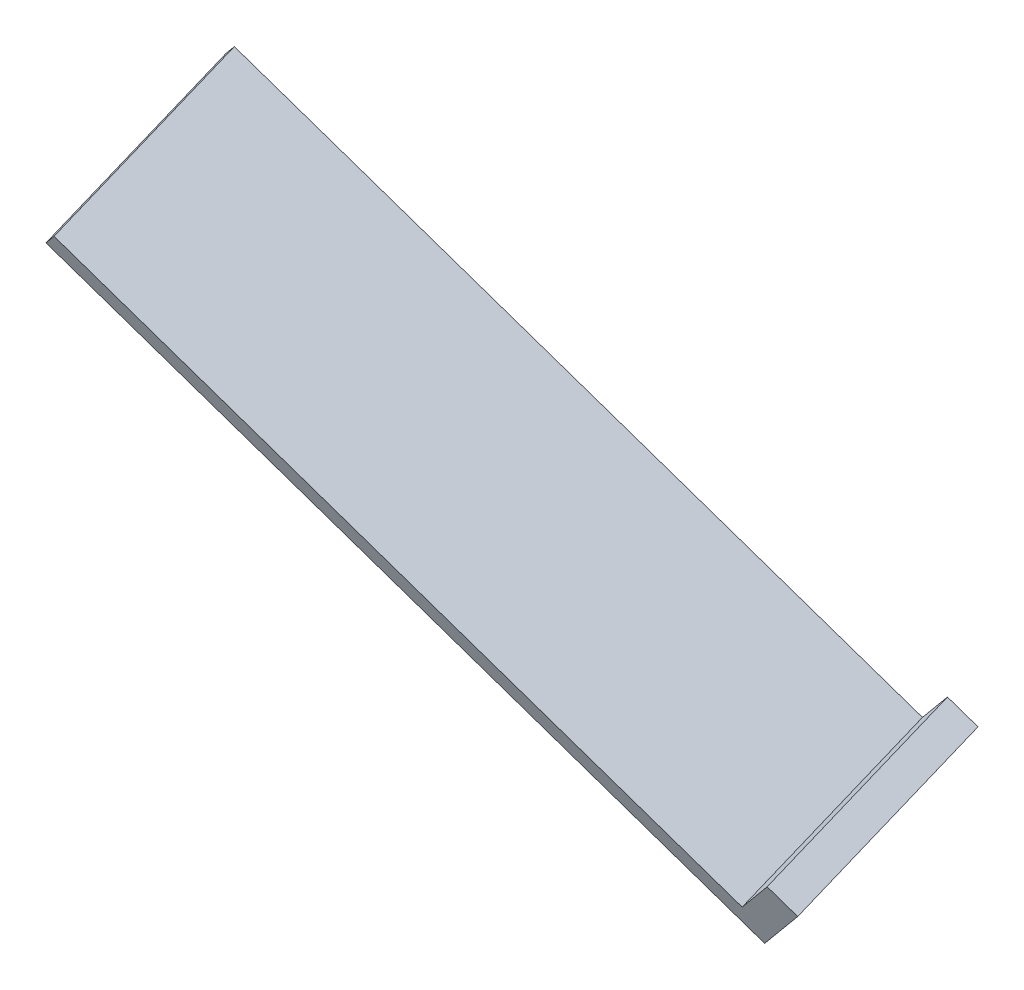
ISO-10303-21;
HEADER;
FILE_DESCRIPTION(('STEP AP214'),'2;1');
FILE_NAME('part.step','',(''),(''),'','','');
FILE_SCHEMA(('AUTOMOTIVE_DESIGN { 1 0 10303 214 1 1 1 1 }'));
ENDSEC;
DATA;
#1=APPLICATION_CONTEXT('core data for automotive mechanical design processes');
#2=APPLICATION_PROTOCOL_DEFINITION('international standard','automotive_design',2000,#1);
#3=PRODUCT_CONTEXT('',#1,'mechanical');
#4=PRODUCT('Part','Part','',(#3));
#5=PRODUCT_RELATED_PRODUCT_CATEGORY('part','',(#4));
#6=PRODUCT_DEFINITION_FORMATION('','',#4);
#7=PRODUCT_DEFINITION_CONTEXT('part definition',#1,'design');
#8=PRODUCT_DEFINITION('design','',#6,#7);
#9=PRODUCT_DEFINITION_SHAPE('','',#8);
#10=(LENGTH_UNIT() NAMED_UNIT(*) SI_UNIT(.MILLI.,.METRE.));
#11=(NAMED_UNIT(*) PLANE_ANGLE_UNIT() SI_UNIT($,.RADIAN.));
#12=(NAMED_UNIT(*) SI_UNIT($,.STERADIAN.) SOLID_ANGLE_UNIT());
#13=UNCERTAINTY_MEASURE_WITH_UNIT(LENGTH_MEASURE(1.E-05),#10,'distance_accuracy_value','');
#14=(GEOMETRIC_REPRESENTATION_CONTEXT(3) GLOBAL_UNCERTAINTY_ASSIGNED_CONTEXT((#13)) GLOBAL_UNIT_ASSIGNED_CONTEXT((#10,
#11,#12)) REPRESENTATION_CONTEXT('',''));
#15=CARTESIAN_POINT('',(0.,0.,0.));
#16=DIRECTION('',(0.,0.,1.));
#17=DIRECTION('',(1.,0.,0.));
#18=AXIS2_PLACEMENT_3D('',#15,#16,#17);
#19=CARTESIAN_POINT('',(-17.7630129407641,-91.721226677061,66.7077406708331));
#20=DIRECTION('',(0.768464217173614,-0.591770543928385,-0.243455068261986));
#21=DIRECTION('',(0.610127966621738,0.792302886745987,0.));
#22=AXIS2_PLACEMENT_3D('',#19,#20,#21);
#23=PLANE('',#22);
#24=DIRECTION('',(6.06413501451987E-08,0.380462361503003,-0.924796405420974));
#25=VECTOR('',#24,1.);
#26=CARTESIAN_POINT('',(-17.1231201787143,-91.0105537460876,67.0001124175153));
#27=LINE('',#26,#25);
#28=CARTESIAN_POINT('',(-17.1231206881016,-94.2064371480939,74.7684011666158));
#29=VERTEX_POINT('',#28);
#30=CARTESIAN_POINT('',(-17.1231201787143,-91.0105537460876,67.0001124175153));
#31=VERTEX_POINT('',#30);
#32=EDGE_CURVE('E131',#29,#31,#27,.T.);
#33=ORIENTED_EDGE('',*,*,#32,.T.);
#34=DIRECTION('',(0.639892762049815,0.710672930973357,0.292371746682194));
#35=VECTOR('',#34,1.);
#36=CARTESIAN_POINT('',(-17.7630129407641,-91.721226677061,66.7077406708331));
#37=LINE('',#36,#35);
#38=CARTESIAN_POINT('',(-17.7630129407641,-91.721226677061,66.7077406708331));
#39=VERTEX_POINT('',#38);
#40=EDGE_CURVE('E11',#39,#31,#37,.T.);
#41=ORIENTED_EDGE('',*,*,#40,.F.);
#42=DIRECTION('',(6.06413501451987E-08,0.380462361503003,-0.924796405420974));
#43=VECTOR('',#42,1.);
#44=CARTESIAN_POINT('',(-17.7630129407641,-91.721226677061,66.7077406708331));
#45=LINE('',#44,#43);
#46=CARTESIAN_POINT('',(-17.7630134501514,-94.9171100790673,74.4760294199336));
#47=VERTEX_POINT('',#46);
#48=EDGE_CURVE('E140',#47,#39,#45,.T.);
#49=ORIENTED_EDGE('',*,*,#48,.F.);
#50=DIRECTION('',(0.639892762049815,0.710672930973357,0.292371746682194));
#51=VECTOR('',#50,1.);
#52=CARTESIAN_POINT('',(-17.7630134501514,-94.9171100790673,74.4760294199336));
#53=LINE('',#52,#51);
#54=EDGE_CURVE('E48',#47,#29,#53,.T.);
#55=ORIENTED_EDGE('',*,*,#54,.T.);
#56=EDGE_LOOP('',(#33,#41,#49,#55));
#57=FACE_BOUND('',#56,.T.);
#58=ADVANCED_FACE('F40',(#57),#23,.F.);
#59=CARTESIAN_POINT('',(4.7539851367896,-109.06087011936,59.5741893293911));
#60=DIRECTION('',(0.,-0.380462408201031,0.924796386209349));
#61=DIRECTION('',(0.,-0.924796386209349,-0.380462408201031));
#62=AXIS2_PLACEMENT_3D('',#59,#60,#61);
#63=PLANE('',#62);
#64=DIRECTION('',(0.768464217173616,-0.591770513905188,-0.243455141239882));
#65=VECTOR('',#64,1.);
#66=CARTESIAN_POINT('',(5.39387789883942,-108.350197188387,59.8665610760733));
#67=LINE('',#66,#65);
#68=CARTESIAN_POINT('',(5.39387789883942,-108.350197188387,59.8665610760733));
#69=VERTEX_POINT('',#68);
#70=EDGE_CURVE('E147',#31,#69,#67,.T.);
#71=ORIENTED_EDGE('',*,*,#70,.T.);
#72=DIRECTION('',(-0.639892762049815,-0.710672930973357,-0.292371746682194));
#73=VECTOR('',#72,1.);
#74=CARTESIAN_POINT('',(13.1754684712432,-99.7078650544686,63.422027495683));
#75=LINE('',#74,#73);
#76=CARTESIAN_POINT('',(7.3775454611939,-106.147111102369,60.7729134907882));
#77=VERTEX_POINT('',#76);
#78=EDGE_CURVE('E134',#77,#69,#75,.T.);
#79=ORIENTED_EDGE('',*,*,#78,.F.);
#80=DIRECTION('',(-0.768464217173616,0.591770513905171,0.243455141239924));
#81=VECTOR('',#80,1.);
#82=CARTESIAN_POINT('',(-33.8802470588002,-74.375761784443,73.8436869643347));
#83=LINE('',#82,#81);
#84=CARTESIAN_POINT('',(8.37754596727365,-106.917180547587,60.4561059426852));
#85=VERTEX_POINT('',#84);
#86=EDGE_CURVE('E128',#85,#77,#83,.T.);
#87=ORIENTED_EDGE('',*,*,#86,.F.);
#88=DIRECTION('',(-0.639892762049815,-0.710672930973357,-0.292371746682194));
#89=VECTOR('',#88,1.);
#90=CARTESIAN_POINT('',(14.1754689773229,-100.477934499686,63.10521994758));
#91=LINE('',#90,#89);
#92=CARTESIAN_POINT('',(5.75398564286936,-109.830939564578,59.2573817812882));
#93=VERTEX_POINT('',#92);
#94=EDGE_CURVE('E137',#85,#93,#91,.T.);
#95=ORIENTED_EDGE('',*,*,#94,.T.);
#96=DIRECTION('',(0.768464217173619,-0.591770513905186,-0.243455141239879));
#97=VECTOR('',#96,1.);
#98=CARTESIAN_POINT('',(-16.7630129440716,-92.4912957300149,66.3909332841078));
#99=LINE('',#98,#97);
#100=EDGE_CURVE('E84',#39,#93,#99,.T.);
#101=ORIENTED_EDGE('',*,*,#100,.F.);
#102=ORIENTED_EDGE('',*,*,#40,.T.);
#103=EDGE_LOOP('',(#71,#79,#87,#95,#101,#102));
#104=FACE_BOUND('',#103,.T.);
#105=ADVANCED_FACE('F161',(#104),#63,.F.);
#106=CARTESIAN_POINT('',(-17.7630134501514,-94.9171100790673,74.4760294199336));
#107=DIRECTION('',(0.,0.380462408201033,-0.924796386209349));
#108=DIRECTION('',(0.,0.924796386209349,0.380462408201033));
#109=AXIS2_PLACEMENT_3D('',#106,#107,#108);
#110=PLANE('',#109);
#111=DIRECTION('',(-0.768464217173618,0.591770513905185,0.243455141239884));
#112=VECTOR('',#111,1.);
#113=CARTESIAN_POINT('',(-17.1231206881016,-94.2064371480939,74.7684011666158));
#114=LINE('',#113,#112);
#115=CARTESIAN_POINT('',(-16.1231206673277,-94.9765062195922,74.4515937722613));
#116=VERTEX_POINT('',#115);
#117=EDGE_CURVE('E77',#116,#29,#114,.T.);
#118=ORIENTED_EDGE('',*,*,#117,.T.);
#119=ORIENTED_EDGE('',*,*,#54,.F.);
#120=DIRECTION('',(-0.768464217173618,0.591770513905185,0.243455141239884));
#121=VECTOR('',#120,1.);
#122=CARTESIAN_POINT('',(-17.7630134501514,-94.9171100790673,74.4760294199336));
#123=LINE('',#122,#121);
#124=CARTESIAN_POINT('',(-16.7630134293775,-95.6871791505656,74.1592220255792));
#125=VERTEX_POINT('',#124);
#126=EDGE_CURVE('E56',#125,#47,#123,.T.);
#127=ORIENTED_EDGE('',*,*,#126,.F.);
#128=DIRECTION('',(-0.768464217173613,0.591770543928385,0.243455068261988));
#129=VECTOR('',#128,1.);
#130=CARTESIAN_POINT('',(-16.7630134293775,-95.6871791505656,74.1592220255792));
#131=LINE('',#130,#129);
#132=CARTESIAN_POINT('',(4.7539851367896,-112.256754754279,67.342479960495));
#133=VERTEX_POINT('',#132);
#134=EDGE_CURVE('E123',#133,#125,#131,.T.);
#135=ORIENTED_EDGE('',*,*,#134,.F.);
#136=DIRECTION('',(-0.768464217173616,0.591770513905188,0.243455141239883));
#137=VECTOR('',#136,1.);
#138=CARTESIAN_POINT('',(-36.5038073832077,-80.4854054754188,80.4132535290064));
#139=LINE('',#138,#137);
#140=CARTESIAN_POINT('',(5.75398564286937,-113.026824238566,67.025672507358));
#141=VERTEX_POINT('',#140);
#142=EDGE_CURVE('E120',#141,#133,#139,.T.);
#143=ORIENTED_EDGE('',*,*,#142,.F.);
#144=DIRECTION('',(-0.639892762049815,-0.710672930973357,-0.292371746682194));
#145=VECTOR('',#144,1.);
#146=CARTESIAN_POINT('',(14.1754689773229,-103.673819173674,70.8735106736498));
#147=LINE('',#146,#145);
#148=CARTESIAN_POINT('',(8.37754596727365,-110.113065221575,68.224396668755));
#149=VERTEX_POINT('',#148);
#150=EDGE_CURVE('E108',#149,#141,#147,.T.);
#151=ORIENTED_EDGE('',*,*,#150,.F.);
#152=DIRECTION('',(-0.768464217173616,0.591770513905188,0.243455141239883));
#153=VECTOR('',#152,1.);
#154=CARTESIAN_POINT('',(-33.8802470588034,-77.5716464584279,81.6119776904034));
#155=LINE('',#154,#153);
#156=CARTESIAN_POINT('',(7.3775454611939,-109.342995756823,68.541204169375));
#157=VERTEX_POINT('',#156);
#158=EDGE_CURVE('E129',#149,#157,#155,.T.);
#159=ORIENTED_EDGE('',*,*,#158,.T.);
#160=DIRECTION('',(-0.639892762049815,-0.710672930973357,-0.292371746682194));
#161=VECTOR('',#160,1.);
#162=CARTESIAN_POINT('',(13.1754684712432,-102.903749689388,71.1903181267869));
#163=LINE('',#162,#161);
#164=CARTESIAN_POINT('',(5.39387789883943,-111.546081823306,67.6348517071772));
#165=VERTEX_POINT('',#164);
#166=EDGE_CURVE('E116',#157,#165,#163,.T.);
#167=ORIENTED_EDGE('',*,*,#166,.T.);
#168=DIRECTION('',(-0.768464217173613,0.591770543928385,0.243455068261988));
#169=VECTOR('',#168,1.);
#170=CARTESIAN_POINT('',(-16.1231206673277,-94.9765062195922,74.4515937722613));
#171=LINE('',#170,#169);
#172=EDGE_CURVE('E74',#165,#116,#171,.T.);
#173=ORIENTED_EDGE('',*,*,#172,.T.);
#174=EDGE_LOOP('',(#118,#119,#127,#135,#143,#151,#159,#167,#173));
#175=FACE_BOUND('',#174,.T.);
#176=ADVANCED_FACE('F122',(#175),#110,.F.);
#177=CARTESIAN_POINT('',(-36.5038073832078,-40.5415865333566,-16.6788602061856));
#178=DIRECTION('',(0.639892762049816,0.710672930973357,0.292371746682194));
#179=DIRECTION('',(-0.743144835446272,0.669130595287298,0.));
#180=AXIS2_PLACEMENT_3D('',#177,#178,#179);
#181=PLANE('',#180);
#182=ORIENTED_EDGE('',*,*,#48,.T.);
#183=ORIENTED_EDGE('',*,*,#100,.T.);
#184=DIRECTION('',(0.,0.380462408201031,-0.924796386209349));
#185=VECTOR('',#184,1.);
#186=CARTESIAN_POINT('',(5.75398564286936,-73.0830052965039,-30.0664412278339));
#187=LINE('',#186,#185);
#188=EDGE_CURVE('E112',#141,#93,#187,.T.);
#189=ORIENTED_EDGE('',*,*,#188,.F.);
#190=ORIENTED_EDGE('',*,*,#142,.T.);
#191=ORIENTED_EDGE('',*,*,#134,.T.);
#192=ORIENTED_EDGE('',*,*,#126,.T.);
#193=EDGE_LOOP('',(#182,#183,#189,#190,#191,#192));
#194=FACE_BOUND('',#193,.T.);
#195=ADVANCED_FACE('F119',(#194),#181,.F.);
#196=CARTESIAN_POINT('',(-35.863914621158,-39.8309136023832,-16.3864884595034));
#197=DIRECTION('',(0.639892762049816,0.710672930973357,0.292371746682194));
#198=DIRECTION('',(-0.743144835446272,0.669130595287298,0.));
#199=AXIS2_PLACEMENT_3D('',#196,#197,#198);
#200=PLANE('',#199);
#201=ORIENTED_EDGE('',*,*,#32,.F.);
#202=ORIENTED_EDGE('',*,*,#117,.F.);
#203=ORIENTED_EDGE('',*,*,#172,.F.);
#204=DIRECTION('',(0.,-0.380462408201032,0.924796386209349));
#205=VECTOR('',#204,1.);
#206=CARTESIAN_POINT('',(5.39387789883942,-111.546081823306,67.6348517071772));
#207=LINE('',#206,#205);
#208=EDGE_CURVE('E149',#69,#165,#207,.T.);
#209=ORIENTED_EDGE('',*,*,#208,.F.);
#210=ORIENTED_EDGE('',*,*,#70,.F.);
#211=EDGE_LOOP('',(#201,#202,#203,#209,#210));
#212=FACE_BOUND('',#211,.T.);
#213=ADVANCED_FACE('F158',(#212),#200,.T.);
#214=CARTESIAN_POINT('',(13.1754684712431,-62.9599307863948,-25.9017955134392));
#215=DIRECTION('',(-0.768464217173616,0.591770513905188,0.243455141239883));
#216=DIRECTION('',(-0.610127947190206,-0.792302901709609,0.));
#217=AXIS2_PLACEMENT_3D('',#214,#215,#216);
#218=PLANE('',#217);
#219=ORIENTED_EDGE('',*,*,#78,.T.);
#220=ORIENTED_EDGE('',*,*,#208,.T.);
#221=ORIENTED_EDGE('',*,*,#166,.F.);
#222=DIRECTION('',(0.,-0.380462408201032,0.924796386209349));
#223=VECTOR('',#222,1.);
#224=CARTESIAN_POINT('',(7.37754546119383,-69.3991768342956,-28.550909518334));
#225=LINE('',#224,#223);
#226=EDGE_CURVE('E126',#77,#157,#225,.T.);
#227=ORIENTED_EDGE('',*,*,#226,.F.);
#228=EDGE_LOOP('',(#219,#220,#221,#227));
#229=FACE_BOUND('',#228,.T.);
#230=ADVANCED_FACE('F171',(#229),#218,.T.);
#231=CARTESIAN_POINT('',(14.1754689773229,-63.7300002316123,-26.2186030615421));
#232=DIRECTION('',(0.768464217173616,-0.591770513905188,-0.243455141239882));
#233=DIRECTION('',(0.610127947190206,0.792302901709608,0.));
#234=AXIS2_PLACEMENT_3D('',#231,#232,#233);
#235=PLANE('',#234);
#236=DIRECTION('',(0.,0.380462408201031,-0.924796386209349));
#237=VECTOR('',#236,1.);
#238=CARTESIAN_POINT('',(8.37754596727365,-70.169246279513,-28.8677170664369));
#239=LINE('',#238,#237);
#240=EDGE_CURVE('E113',#149,#85,#239,.T.);
#241=ORIENTED_EDGE('',*,*,#240,.F.);
#242=ORIENTED_EDGE('',*,*,#150,.T.);
#243=ORIENTED_EDGE('',*,*,#188,.T.);
#244=ORIENTED_EDGE('',*,*,#94,.F.);
#245=EDGE_LOOP('',(#241,#242,#243,#244));
#246=FACE_BOUND('',#245,.T.);
#247=ADVANCED_FACE('F110',(#246),#235,.T.);
#248=CARTESIAN_POINT('',(-33.8802470588035,-37.6278275163658,-15.4801360447886));
#249=DIRECTION('',(-0.639892762049815,-0.710672930973357,-0.292371746682194));
#250=DIRECTION('',(0.743144835446272,-0.669130595287297,0.));
#251=AXIS2_PLACEMENT_3D('',#248,#249,#250);
#252=PLANE('',#251);
#253=ORIENTED_EDGE('',*,*,#240,.T.);
#254=ORIENTED_EDGE('',*,*,#86,.T.);
#255=ORIENTED_EDGE('',*,*,#226,.T.);
#256=ORIENTED_EDGE('',*,*,#158,.F.);
#257=EDGE_LOOP('',(#253,#254,#255,#256));
#258=FACE_BOUND('',#257,.T.);
#259=ADVANCED_FACE('F176',(#258),#252,.F.);
#260=CLOSED_SHELL('',(#58,#105,#176,#195,#213,#230,#247,#259));
#261=MANIFOLD_SOLID_BREP('B2',#260);
#262=ADVANCED_BREP_SHAPE_REPRESENTATION('',(#18,#261),#14);
#263=SHAPE_DEFINITION_REPRESENTATION(#9,#262);
ENDSEC;
END-ISO-10303-21;
